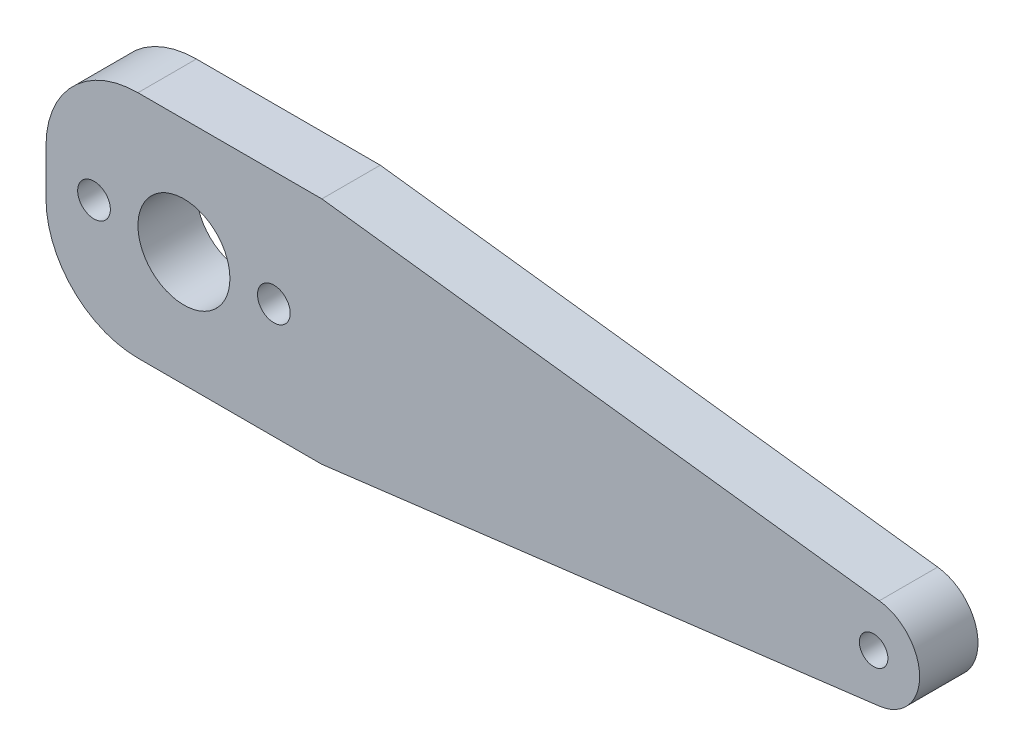
ISO-10303-21;
HEADER;
FILE_DESCRIPTION(('STEP AP214'),'2;1');
FILE_NAME('part.step','',(''),(''),'','','');
FILE_SCHEMA(('AUTOMOTIVE_DESIGN { 1 0 10303 214 1 1 1 1 }'));
ENDSEC;
DATA;
#1=APPLICATION_CONTEXT('core data for automotive mechanical design processes');
#2=APPLICATION_PROTOCOL_DEFINITION('international standard','automotive_design',2000,#1);
#3=PRODUCT_CONTEXT('',#1,'mechanical');
#4=PRODUCT('Part','Part','',(#3));
#5=PRODUCT_RELATED_PRODUCT_CATEGORY('part','',(#4));
#6=PRODUCT_DEFINITION_FORMATION('','',#4);
#7=PRODUCT_DEFINITION_CONTEXT('part definition',#1,'design');
#8=PRODUCT_DEFINITION('design','',#6,#7);
#9=PRODUCT_DEFINITION_SHAPE('','',#8);
#10=(LENGTH_UNIT() NAMED_UNIT(*) SI_UNIT(.MILLI.,.METRE.));
#11=(NAMED_UNIT(*) PLANE_ANGLE_UNIT() SI_UNIT($,.RADIAN.));
#12=(NAMED_UNIT(*) SI_UNIT($,.STERADIAN.) SOLID_ANGLE_UNIT());
#13=UNCERTAINTY_MEASURE_WITH_UNIT(LENGTH_MEASURE(1.E-05),#10,'distance_accuracy_value','');
#14=(GEOMETRIC_REPRESENTATION_CONTEXT(3) GLOBAL_UNCERTAINTY_ASSIGNED_CONTEXT((#13)) GLOBAL_UNIT_ASSIGNED_CONTEXT((#10,
#11,#12)) REPRESENTATION_CONTEXT('',''));
#15=CARTESIAN_POINT('',(0.,0.,0.));
#16=DIRECTION('',(0.,0.,1.));
#17=DIRECTION('',(1.,0.,0.));
#18=AXIS2_PLACEMENT_3D('',#15,#16,#17);
#19=CARTESIAN_POINT('',(0.456876018990245,-3.67390049851367,6.35));
#20=DIRECTION('',(-0.123406647442543,0.992356185735239,0.));
#21=DIRECTION('',(-0.992356185735239,-0.123406647442543,0.));
#22=AXIS2_PLACEMENT_3D('',#19,#20,#21);
#23=PLANE('',#22);
#24=DIRECTION('',(0.992356185735239,0.123406647442543,0.));
#25=VECTOR('',#24,1.);
#26=CARTESIAN_POINT('',(0.456876018990245,-3.67390049851367,0.));
#27=LINE('',#26,#25);
#28=CARTESIAN_POINT('',(30.,0.,0.));
#29=VERTEX_POINT('',#28);
#30=CARTESIAN_POINT('',(90.6170332372127,7.53816518428338,0.));
#31=VERTEX_POINT('',#30);
#32=EDGE_CURVE('E133',#29,#31,#27,.T.);
#33=ORIENTED_EDGE('',*,*,#32,.T.);
#34=DIRECTION('',(0.,0.,-1.));
#35=VECTOR('',#34,1.);
#36=CARTESIAN_POINT('',(90.6170332372127,7.53816518428338,6.35));
#37=LINE('',#36,#35);
#38=CARTESIAN_POINT('',(90.6170332372127,7.53816518428338,6.35));
#39=VERTEX_POINT('',#38);
#40=EDGE_CURVE('E112',#39,#31,#37,.T.);
#41=ORIENTED_EDGE('',*,*,#40,.F.);
#42=DIRECTION('',(0.992356185735239,0.123406647442543,0.));
#43=VECTOR('',#42,1.);
#44=CARTESIAN_POINT('',(0.456876018990245,-3.67390049851367,6.35));
#45=LINE('',#44,#43);
#46=CARTESIAN_POINT('',(30.,0.,6.35));
#47=VERTEX_POINT('',#46);
#48=EDGE_CURVE('E119',#47,#39,#45,.T.);
#49=ORIENTED_EDGE('',*,*,#48,.F.);
#50=DIRECTION('',(0.,0.,-1.));
#51=VECTOR('',#50,1.);
#52=CARTESIAN_POINT('',(30.,0.,6.35));
#53=LINE('',#52,#51);
#54=EDGE_CURVE('E168',#47,#29,#53,.T.);
#55=ORIENTED_EDGE('',*,*,#54,.T.);
#56=EDGE_LOOP('',(#33,#41,#49,#55));
#57=FACE_BOUND('',#56,.T.);
#58=ADVANCED_FACE('F41',(#57),#23,.F.);
#59=CARTESIAN_POINT('',(90.,12.4999461129596,6.35));
#60=DIRECTION('',(0.,0.,-1.));
#61=DIRECTION('',(-1.,0.,0.));
#62=AXIS2_PLACEMENT_3D('',#59,#60,#61);
#63=CYLINDRICAL_SURFACE('',#62,5.);
#64=CARTESIAN_POINT('',(90.,12.4999461129596,0.));
#65=DIRECTION('',(0.,0.,1.));
#66=DIRECTION('',(1.,0.,0.));
#67=AXIS2_PLACEMENT_3D('',#64,#65,#66);
#68=CIRCLE('',#67,5.);
#69=CARTESIAN_POINT('',(90.6170419246609,17.4617259612812,0.));
#70=VERTEX_POINT('',#69);
#71=EDGE_CURVE('E217',#31,#70,#68,.T.);
#72=ORIENTED_EDGE('',*,*,#71,.T.);
#73=DIRECTION('',(0.,0.,-1.));
#74=VECTOR('',#73,1.);
#75=CARTESIAN_POINT('',(90.6170419246609,17.4617259612812,6.35));
#76=LINE('',#75,#74);
#77=CARTESIAN_POINT('',(90.6170419246609,17.4617259612812,6.35));
#78=VERTEX_POINT('',#77);
#79=EDGE_CURVE('E114',#78,#70,#76,.T.);
#80=ORIENTED_EDGE('',*,*,#79,.F.);
#81=CARTESIAN_POINT('',(90.,12.4999461129596,6.35));
#82=DIRECTION('',(0.,0.,1.));
#83=DIRECTION('',(1.,0.,0.));
#84=AXIS2_PLACEMENT_3D('',#81,#82,#83);
#85=CIRCLE('',#84,5.);
#86=EDGE_CURVE('E107',#39,#78,#85,.T.);
#87=ORIENTED_EDGE('',*,*,#86,.F.);
#88=ORIENTED_EDGE('',*,*,#40,.T.);
#89=EDGE_LOOP('',(#72,#80,#87,#88));
#90=FACE_BOUND('',#89,.T.);
#91=ADVANCED_FACE('F110',(#90),#63,.T.);
#92=CARTESIAN_POINT('',(3.51851507149891,28.2932106880331,6.35));
#93=DIRECTION('',(0.123408384932173,0.99235596966433,0.));
#94=DIRECTION('',(-0.99235596966433,0.123408384932173,0.));
#95=AXIS2_PLACEMENT_3D('',#92,#93,#94);
#96=PLANE('',#95);
#97=DIRECTION('',(0.99235596966433,-0.123408384932173,0.));
#98=VECTOR('',#97,1.);
#99=CARTESIAN_POINT('',(3.51851507149891,28.2932106880331,0.));
#100=LINE('',#99,#98);
#101=CARTESIAN_POINT('',(30.,25.,0.));
#102=VERTEX_POINT('',#101);
#103=EDGE_CURVE('E190',#102,#70,#100,.T.);
#104=ORIENTED_EDGE('',*,*,#103,.F.);
#105=DIRECTION('',(0.,0.,-1.));
#106=VECTOR('',#105,1.);
#107=CARTESIAN_POINT('',(30.,25.,6.35));
#108=LINE('',#107,#106);
#109=CARTESIAN_POINT('',(30.,25.,6.35));
#110=VERTEX_POINT('',#109);
#111=EDGE_CURVE('E142',#110,#102,#108,.T.);
#112=ORIENTED_EDGE('',*,*,#111,.F.);
#113=DIRECTION('',(0.99235596966433,-0.123408384932173,0.));
#114=VECTOR('',#113,1.);
#115=CARTESIAN_POINT('',(3.51851507149891,28.2932106880331,6.35));
#116=LINE('',#115,#114);
#117=EDGE_CURVE('E118',#110,#78,#116,.T.);
#118=ORIENTED_EDGE('',*,*,#117,.T.);
#119=ORIENTED_EDGE('',*,*,#79,.T.);
#120=EDGE_LOOP('',(#104,#112,#118,#119));
#121=FACE_BOUND('',#120,.T.);
#122=ADVANCED_FACE('F215',(#121),#96,.T.);
#123=CARTESIAN_POINT('',(0.,25.,6.35));
#124=DIRECTION('',(0.,1.,0.));
#125=DIRECTION('',(0.,0.,1.));
#126=AXIS2_PLACEMENT_3D('',#123,#124,#125);
#127=PLANE('',#126);
#128=DIRECTION('',(1.,0.,0.));
#129=VECTOR('',#128,1.);
#130=CARTESIAN_POINT('',(0.,25.,0.));
#131=LINE('',#130,#129);
#132=CARTESIAN_POINT('',(10.,25.,0.));
#133=VERTEX_POINT('',#132);
#134=EDGE_CURVE('E184',#133,#102,#131,.T.);
#135=ORIENTED_EDGE('',*,*,#134,.F.);
#136=DIRECTION('',(0.,0.,-1.));
#137=VECTOR('',#136,1.);
#138=CARTESIAN_POINT('',(10.,25.,6.35));
#139=LINE('',#138,#137);
#140=CARTESIAN_POINT('',(10.,25.,6.35));
#141=VERTEX_POINT('',#140);
#142=EDGE_CURVE('E11',#133,#141,#139,.F.);
#143=ORIENTED_EDGE('',*,*,#142,.T.);
#144=DIRECTION('',(1.,0.,0.));
#145=VECTOR('',#144,1.);
#146=CARTESIAN_POINT('',(0.,25.,6.35));
#147=LINE('',#146,#145);
#148=EDGE_CURVE('E212',#141,#110,#147,.T.);
#149=ORIENTED_EDGE('',*,*,#148,.T.);
#150=ORIENTED_EDGE('',*,*,#111,.T.);
#151=EDGE_LOOP('',(#135,#143,#149,#150));
#152=FACE_BOUND('',#151,.T.);
#153=ADVANCED_FACE('F211',(#152),#127,.T.);
#154=CARTESIAN_POINT('',(0.,0.,6.35));
#155=DIRECTION('',(-1.,0.,0.));
#156=DIRECTION('',(0.,0.,1.));
#157=AXIS2_PLACEMENT_3D('',#154,#155,#156);
#158=PLANE('',#157);
#159=DIRECTION('',(0.,1.,0.));
#160=VECTOR('',#159,1.);
#161=CARTESIAN_POINT('',(0.,0.,0.));
#162=LINE('',#161,#160);
#163=CARTESIAN_POINT('',(0.,10.,0.));
#164=VERTEX_POINT('',#163);
#165=CARTESIAN_POINT('',(0.,15.,0.));
#166=VERTEX_POINT('',#165);
#167=EDGE_CURVE('E178',#164,#166,#162,.T.);
#168=ORIENTED_EDGE('',*,*,#167,.F.);
#169=DIRECTION('',(0.,0.,-1.));
#170=VECTOR('',#169,1.);
#171=CARTESIAN_POINT('',(0.,10.,6.35));
#172=LINE('',#171,#170);
#173=CARTESIAN_POINT('',(0.,10.,6.35));
#174=VERTEX_POINT('',#173);
#175=EDGE_CURVE('E155',#164,#174,#172,.F.);
#176=ORIENTED_EDGE('',*,*,#175,.T.);
#177=DIRECTION('',(0.,1.,0.));
#178=VECTOR('',#177,1.);
#179=CARTESIAN_POINT('',(0.,0.,6.35));
#180=LINE('',#179,#178);
#181=CARTESIAN_POINT('',(0.,15.,6.35));
#182=VERTEX_POINT('',#181);
#183=EDGE_CURVE('E161',#174,#182,#180,.T.);
#184=ORIENTED_EDGE('',*,*,#183,.T.);
#185=DIRECTION('',(0.,0.,-1.));
#186=VECTOR('',#185,1.);
#187=CARTESIAN_POINT('',(0.,15.,6.35));
#188=LINE('',#187,#186);
#189=EDGE_CURVE('E151',#182,#166,#188,.T.);
#190=ORIENTED_EDGE('',*,*,#189,.T.);
#191=EDGE_LOOP('',(#168,#176,#184,#190));
#192=FACE_BOUND('',#191,.T.);
#193=ADVANCED_FACE('F181',(#192),#158,.T.);
#194=CARTESIAN_POINT('',(15.,12.4999461129596,6.35));
#195=DIRECTION('',(0.,0.,-1.));
#196=DIRECTION('',(-1.,0.,0.));
#197=AXIS2_PLACEMENT_3D('',#194,#195,#196);
#198=CYLINDRICAL_SURFACE('',#197,5.);
#199=CARTESIAN_POINT('',(15.,12.4999461129596,6.35));
#200=DIRECTION('',(0.,0.,1.));
#201=DIRECTION('',(1.,0.,0.));
#202=AXIS2_PLACEMENT_3D('',#199,#200,#201);
#203=CIRCLE('',#202,5.);
#204=CARTESIAN_POINT('',(20.,12.4999461129596,6.35));
#205=VERTEX_POINT('',#204);
#206=EDGE_CURVE('E230',#205,#205,#203,.T.);
#207=ORIENTED_EDGE('',*,*,#206,.T.);
#208=EDGE_LOOP('',(#207));
#209=FACE_BOUND('',#208,.T.);
#210=CARTESIAN_POINT('',(15.,12.4999461129596,0.));
#211=DIRECTION('',(0.,0.,1.));
#212=DIRECTION('',(1.,0.,0.));
#213=AXIS2_PLACEMENT_3D('',#210,#211,#212);
#214=CIRCLE('',#213,5.);
#215=CARTESIAN_POINT('',(20.,12.4999461129596,0.));
#216=VERTEX_POINT('',#215);
#217=EDGE_CURVE('E197',#216,#216,#214,.T.);
#218=ORIENTED_EDGE('',*,*,#217,.F.);
#219=EDGE_LOOP('',(#218));
#220=FACE_BOUND('',#219,.T.);
#221=ADVANCED_FACE('F315',(#209,#220),#198,.F.);
#222=CARTESIAN_POINT('',(5.221,12.4999461129596,6.35));
#223=DIRECTION('',(0.,0.,-1.));
#224=DIRECTION('',(-1.,0.,0.));
#225=AXIS2_PLACEMENT_3D('',#222,#223,#224);
#226=CYLINDRICAL_SURFACE('',#225,1.778);
#227=CARTESIAN_POINT('',(5.221,12.4999461129596,6.35));
#228=DIRECTION('',(0.,0.,1.));
#229=DIRECTION('',(1.,0.,0.));
#230=AXIS2_PLACEMENT_3D('',#227,#228,#229);
#231=CIRCLE('',#230,1.778);
#232=CARTESIAN_POINT('',(6.999,12.4999461129596,6.35));
#233=VERTEX_POINT('',#232);
#234=EDGE_CURVE('E170',#233,#233,#231,.T.);
#235=ORIENTED_EDGE('',*,*,#234,.T.);
#236=EDGE_LOOP('',(#235));
#237=FACE_BOUND('',#236,.T.);
#238=CARTESIAN_POINT('',(5.221,12.4999461129596,0.));
#239=DIRECTION('',(0.,0.,1.));
#240=DIRECTION('',(1.,0.,0.));
#241=AXIS2_PLACEMENT_3D('',#238,#239,#240);
#242=CIRCLE('',#241,1.778);
#243=CARTESIAN_POINT('',(6.999,12.4999461129596,0.));
#244=VERTEX_POINT('',#243);
#245=EDGE_CURVE('E188',#244,#244,#242,.T.);
#246=ORIENTED_EDGE('',*,*,#245,.F.);
#247=EDGE_LOOP('',(#246));
#248=FACE_BOUND('',#247,.T.);
#249=ADVANCED_FACE('F303',(#237,#248),#226,.F.);
#250=CARTESIAN_POINT('',(0.,0.,6.35));
#251=DIRECTION('',(0.,1.,0.));
#252=DIRECTION('',(0.,0.,1.));
#253=AXIS2_PLACEMENT_3D('',#250,#251,#252);
#254=PLANE('',#253);
#255=DIRECTION('',(1.,0.,0.));
#256=VECTOR('',#255,1.);
#257=CARTESIAN_POINT('',(0.,0.,6.35));
#258=LINE('',#257,#256);
#259=CARTESIAN_POINT('',(10.,0.,6.35));
#260=VERTEX_POINT('',#259);
#261=EDGE_CURVE('E125',#260,#47,#258,.T.);
#262=ORIENTED_EDGE('',*,*,#261,.F.);
#263=DIRECTION('',(0.,0.,-1.));
#264=VECTOR('',#263,1.);
#265=CARTESIAN_POINT('',(10.,0.,0.));
#266=LINE('',#265,#264);
#267=CARTESIAN_POINT('',(10.,0.,0.));
#268=VERTEX_POINT('',#267);
#269=EDGE_CURVE('E135',#260,#268,#266,.T.);
#270=ORIENTED_EDGE('',*,*,#269,.T.);
#271=DIRECTION('',(1.,0.,0.));
#272=VECTOR('',#271,1.);
#273=CARTESIAN_POINT('',(0.,0.,0.));
#274=LINE('',#273,#272);
#275=EDGE_CURVE('E179',#268,#29,#274,.T.);
#276=ORIENTED_EDGE('',*,*,#275,.T.);
#277=ORIENTED_EDGE('',*,*,#54,.F.);
#278=EDGE_LOOP('',(#262,#270,#276,#277));
#279=FACE_BOUND('',#278,.T.);
#280=ADVANCED_FACE('F166',(#279),#254,.F.);
#281=CARTESIAN_POINT('',(24.779,12.4999461129596,6.35));
#282=DIRECTION('',(0.,0.,-1.));
#283=DIRECTION('',(-1.,0.,0.));
#284=AXIS2_PLACEMENT_3D('',#281,#282,#283);
#285=CYLINDRICAL_SURFACE('',#284,1.778);
#286=CARTESIAN_POINT('',(24.779,12.4999461129596,6.35));
#287=DIRECTION('',(0.,0.,1.));
#288=DIRECTION('',(1.,0.,0.));
#289=AXIS2_PLACEMENT_3D('',#286,#287,#288);
#290=CIRCLE('',#289,1.778);
#291=CARTESIAN_POINT('',(26.557,12.4999461129596,6.35));
#292=VERTEX_POINT('',#291);
#293=EDGE_CURVE('E130',#292,#292,#290,.T.);
#294=ORIENTED_EDGE('',*,*,#293,.T.);
#295=EDGE_LOOP('',(#294));
#296=FACE_BOUND('',#295,.T.);
#297=CARTESIAN_POINT('',(24.779,12.4999461129596,0.));
#298=DIRECTION('',(0.,0.,1.));
#299=DIRECTION('',(1.,0.,0.));
#300=AXIS2_PLACEMENT_3D('',#297,#298,#299);
#301=CIRCLE('',#300,1.778);
#302=CARTESIAN_POINT('',(26.557,12.4999461129596,0.));
#303=VERTEX_POINT('',#302);
#304=EDGE_CURVE('E223',#303,#303,#301,.T.);
#305=ORIENTED_EDGE('',*,*,#304,.F.);
#306=EDGE_LOOP('',(#305));
#307=FACE_BOUND('',#306,.T.);
#308=ADVANCED_FACE('F247',(#296,#307),#285,.F.);
#309=CARTESIAN_POINT('',(90.,12.4999461129596,6.35));
#310=DIRECTION('',(0.,0.,-1.));
#311=DIRECTION('',(-1.,0.,0.));
#312=AXIS2_PLACEMENT_3D('',#309,#310,#311);
#313=CYLINDRICAL_SURFACE('',#312,1.54999999999999);
#314=CARTESIAN_POINT('',(90.,12.4999461129596,6.35));
#315=DIRECTION('',(0.,0.,1.));
#316=DIRECTION('',(1.,0.,0.));
#317=AXIS2_PLACEMENT_3D('',#314,#315,#316);
#318=CIRCLE('',#317,1.54999999999999);
#319=CARTESIAN_POINT('',(91.55,12.4999461129596,6.35));
#320=VERTEX_POINT('',#319);
#321=EDGE_CURVE('E206',#320,#320,#318,.T.);
#322=ORIENTED_EDGE('',*,*,#321,.T.);
#323=EDGE_LOOP('',(#322));
#324=FACE_BOUND('',#323,.T.);
#325=CARTESIAN_POINT('',(90.,12.4999461129596,0.));
#326=DIRECTION('',(0.,0.,1.));
#327=DIRECTION('',(1.,0.,0.));
#328=AXIS2_PLACEMENT_3D('',#325,#326,#327);
#329=CIRCLE('',#328,1.54999999999999);
#330=CARTESIAN_POINT('',(91.55,12.4999461129596,0.));
#331=VERTEX_POINT('',#330);
#332=EDGE_CURVE('E201',#331,#331,#329,.T.);
#333=ORIENTED_EDGE('',*,*,#332,.F.);
#334=EDGE_LOOP('',(#333));
#335=FACE_BOUND('',#334,.T.);
#336=ADVANCED_FACE('F251',(#324,#335),#313,.F.);
#337=CARTESIAN_POINT('',(0.,0.,6.35));
#338=DIRECTION('',(0.,0.,1.));
#339=DIRECTION('',(1.,0.,0.));
#340=AXIS2_PLACEMENT_3D('',#337,#338,#339);
#341=PLANE('',#340);
#342=ORIENTED_EDGE('',*,*,#293,.F.);
#343=EDGE_LOOP('',(#342));
#344=FACE_BOUND('',#343,.T.);
#345=ORIENTED_EDGE('',*,*,#183,.F.);
#346=CARTESIAN_POINT('',(10.,10.,6.35));
#347=DIRECTION('',(0.,0.,1.));
#348=DIRECTION('',(1.,0.,0.));
#349=AXIS2_PLACEMENT_3D('',#346,#347,#348);
#350=CIRCLE('',#349,10.);
#351=EDGE_CURVE('E50',#174,#260,#350,.T.);
#352=ORIENTED_EDGE('',*,*,#351,.T.);
#353=ORIENTED_EDGE('',*,*,#261,.T.);
#354=ORIENTED_EDGE('',*,*,#48,.T.);
#355=ORIENTED_EDGE('',*,*,#86,.T.);
#356=ORIENTED_EDGE('',*,*,#117,.F.);
#357=ORIENTED_EDGE('',*,*,#148,.F.);
#358=CARTESIAN_POINT('',(10.,15.,6.35));
#359=DIRECTION('',(0.,0.,1.));
#360=DIRECTION('',(1.,0.,0.));
#361=AXIS2_PLACEMENT_3D('',#358,#359,#360);
#362=CIRCLE('',#361,10.);
#363=EDGE_CURVE('E62',#141,#182,#362,.T.);
#364=ORIENTED_EDGE('',*,*,#363,.T.);
#365=EDGE_LOOP('',(#345,#352,#353,#354,#355,#356,#357,#364));
#366=FACE_BOUND('',#365,.T.);
#367=ORIENTED_EDGE('',*,*,#234,.F.);
#368=EDGE_LOOP('',(#367));
#369=FACE_BOUND('',#368,.T.);
#370=ORIENTED_EDGE('',*,*,#206,.F.);
#371=EDGE_LOOP('',(#370));
#372=FACE_BOUND('',#371,.T.);
#373=ORIENTED_EDGE('',*,*,#321,.F.);
#374=EDGE_LOOP('',(#373));
#375=FACE_BOUND('',#374,.T.);
#376=ADVANCED_FACE('F122',(#344,#366,#369,#372,#375),#341,.T.);
#377=CARTESIAN_POINT('',(0.,0.,0.));
#378=DIRECTION('',(0.,0.,1.));
#379=DIRECTION('',(1.,0.,0.));
#380=AXIS2_PLACEMENT_3D('',#377,#378,#379);
#381=PLANE('',#380);
#382=ORIENTED_EDGE('',*,*,#304,.T.);
#383=EDGE_LOOP('',(#382));
#384=FACE_BOUND('',#383,.T.);
#385=ORIENTED_EDGE('',*,*,#275,.F.);
#386=CARTESIAN_POINT('',(10.,10.,0.));
#387=DIRECTION('',(0.,0.,1.));
#388=DIRECTION('',(1.,0.,0.));
#389=AXIS2_PLACEMENT_3D('',#386,#387,#388);
#390=CIRCLE('',#389,10.);
#391=EDGE_CURVE('E148',#268,#164,#390,.F.);
#392=ORIENTED_EDGE('',*,*,#391,.T.);
#393=ORIENTED_EDGE('',*,*,#167,.T.);
#394=CARTESIAN_POINT('',(10.,15.,0.));
#395=DIRECTION('',(0.,0.,1.));
#396=DIRECTION('',(1.,0.,0.));
#397=AXIS2_PLACEMENT_3D('',#394,#395,#396);
#398=CIRCLE('',#397,10.);
#399=EDGE_CURVE('E140',#166,#133,#398,.F.);
#400=ORIENTED_EDGE('',*,*,#399,.T.);
#401=ORIENTED_EDGE('',*,*,#134,.T.);
#402=ORIENTED_EDGE('',*,*,#103,.T.);
#403=ORIENTED_EDGE('',*,*,#71,.F.);
#404=ORIENTED_EDGE('',*,*,#32,.F.);
#405=EDGE_LOOP('',(#385,#392,#393,#400,#401,#402,#403,#404));
#406=FACE_BOUND('',#405,.T.);
#407=ORIENTED_EDGE('',*,*,#245,.T.);
#408=EDGE_LOOP('',(#407));
#409=FACE_BOUND('',#408,.T.);
#410=ORIENTED_EDGE('',*,*,#217,.T.);
#411=EDGE_LOOP('',(#410));
#412=FACE_BOUND('',#411,.T.);
#413=ORIENTED_EDGE('',*,*,#332,.T.);
#414=EDGE_LOOP('',(#413));
#415=FACE_BOUND('',#414,.T.);
#416=ADVANCED_FACE('F176',(#384,#406,#409,#412,#415),#381,.F.);
#417=CARTESIAN_POINT('',(10.,10.,6.35));
#418=DIRECTION('',(0.,0.,1.));
#419=DIRECTION('',(1.,0.,0.));
#420=AXIS2_PLACEMENT_3D('',#417,#418,#419);
#421=CYLINDRICAL_SURFACE('',#420,10.);
#422=ORIENTED_EDGE('',*,*,#351,.F.);
#423=ORIENTED_EDGE('',*,*,#175,.F.);
#424=ORIENTED_EDGE('',*,*,#391,.F.);
#425=ORIENTED_EDGE('',*,*,#269,.F.);
#426=EDGE_LOOP('',(#422,#423,#424,#425));
#427=FACE_BOUND('',#426,.T.);
#428=ADVANCED_FACE('F172',(#427),#421,.T.);
#429=CARTESIAN_POINT('',(10.,15.,6.35));
#430=DIRECTION('',(0.,0.,-1.));
#431=DIRECTION('',(-1.,0.,0.));
#432=AXIS2_PLACEMENT_3D('',#429,#430,#431);
#433=CYLINDRICAL_SURFACE('',#432,10.);
#434=ORIENTED_EDGE('',*,*,#363,.F.);
#435=ORIENTED_EDGE('',*,*,#142,.F.);
#436=ORIENTED_EDGE('',*,*,#399,.F.);
#437=ORIENTED_EDGE('',*,*,#189,.F.);
#438=EDGE_LOOP('',(#434,#435,#436,#437));
#439=FACE_BOUND('',#438,.T.);
#440=ADVANCED_FACE('F43',(#439),#433,.T.);
#441=CLOSED_SHELL('',(#58,#91,#122,#153,#193,#221,#249,#280,#308,#336,#376,#416,#428,#440));
#442=MANIFOLD_SOLID_BREP('B2',#441);
#443=ADVANCED_BREP_SHAPE_REPRESENTATION('',(#18,#442),#14);
#444=SHAPE_DEFINITION_REPRESENTATION(#9,#443);
ENDSEC;
END-ISO-10303-21;
